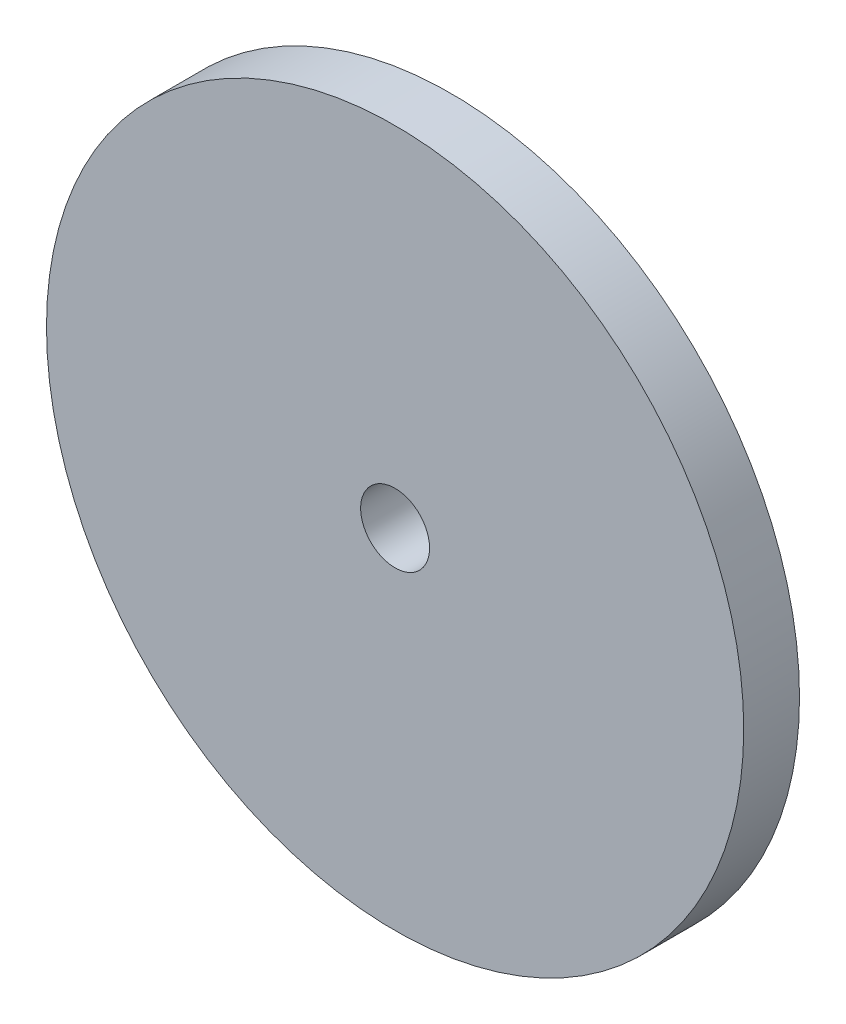
ISO-10303-21;
HEADER;
FILE_DESCRIPTION(('STEP AP214'),'2;1');
FILE_NAME('part.step','',(''),(''),'','','');
FILE_SCHEMA(('AUTOMOTIVE_DESIGN { 1 0 10303 214 1 1 1 1 }'));
ENDSEC;
DATA;
#1=APPLICATION_CONTEXT('core data for automotive mechanical design processes');
#2=APPLICATION_PROTOCOL_DEFINITION('international standard','automotive_design',2000,#1);
#3=PRODUCT_CONTEXT('',#1,'mechanical');
#4=PRODUCT('Part','Part','',(#3));
#5=PRODUCT_RELATED_PRODUCT_CATEGORY('part','',(#4));
#6=PRODUCT_DEFINITION_FORMATION('','',#4);
#7=PRODUCT_DEFINITION_CONTEXT('part definition',#1,'design');
#8=PRODUCT_DEFINITION('design','',#6,#7);
#9=PRODUCT_DEFINITION_SHAPE('','',#8);
#10=(LENGTH_UNIT() NAMED_UNIT(*) SI_UNIT(.MILLI.,.METRE.));
#11=(NAMED_UNIT(*) PLANE_ANGLE_UNIT() SI_UNIT($,.RADIAN.));
#12=(NAMED_UNIT(*) SI_UNIT($,.STERADIAN.) SOLID_ANGLE_UNIT());
#13=UNCERTAINTY_MEASURE_WITH_UNIT(LENGTH_MEASURE(1.E-05),#10,'distance_accuracy_value','');
#14=(GEOMETRIC_REPRESENTATION_CONTEXT(3) GLOBAL_UNCERTAINTY_ASSIGNED_CONTEXT((#13)) GLOBAL_UNIT_ASSIGNED_CONTEXT((#10,
#11,#12)) REPRESENTATION_CONTEXT('',''));
#15=CARTESIAN_POINT('',(0.,0.,0.));
#16=DIRECTION('',(0.,0.,1.));
#17=DIRECTION('',(1.,0.,0.));
#18=AXIS2_PLACEMENT_3D('',#15,#16,#17);
#19=CARTESIAN_POINT('',(0.,0.,0.));
#20=DIRECTION('',(0.,0.,1.));
#21=DIRECTION('',(1.,0.,0.));
#22=AXIS2_PLACEMENT_3D('',#19,#20,#21);
#23=CYLINDRICAL_SURFACE('',#22,3.1369);
#24=CARTESIAN_POINT('',(0.,0.,-5.08));
#25=DIRECTION('',(0.,0.,1.));
#26=DIRECTION('',(1.,0.,0.));
#27=AXIS2_PLACEMENT_3D('',#24,#25,#26);
#28=CIRCLE('',#27,3.1369);
#29=CARTESIAN_POINT('',(3.1369,0.,-5.08));
#30=VERTEX_POINT('',#29);
#31=EDGE_CURVE('E45',#30,#30,#28,.T.);
#32=ORIENTED_EDGE('',*,*,#31,.F.);
#33=EDGE_LOOP('',(#32));
#34=FACE_BOUND('',#33,.T.);
#35=CARTESIAN_POINT('',(0.,0.,0.));
#36=DIRECTION('',(0.,0.,1.));
#37=DIRECTION('',(1.,0.,0.));
#38=AXIS2_PLACEMENT_3D('',#35,#36,#37);
#39=CIRCLE('',#38,3.1369);
#40=CARTESIAN_POINT('',(3.1369,0.,0.));
#41=VERTEX_POINT('',#40);
#42=EDGE_CURVE('E10',#41,#41,#39,.T.);
#43=ORIENTED_EDGE('',*,*,#42,.T.);
#44=EDGE_LOOP('',(#43));
#45=FACE_BOUND('',#44,.T.);
#46=ADVANCED_FACE('F31',(#34,#45),#23,.F.);
#47=CARTESIAN_POINT('',(0.,3.1369,0.));
#48=DIRECTION('',(0.,0.,-1.));
#49=DIRECTION('',(-1.,0.,0.));
#50=AXIS2_PLACEMENT_3D('',#47,#48,#49);
#51=PLANE('',#50);
#52=ORIENTED_EDGE('',*,*,#42,.F.);
#53=EDGE_LOOP('',(#52));
#54=FACE_BOUND('',#53,.T.);
#55=CARTESIAN_POINT('',(0.,0.,0.));
#56=DIRECTION('',(0.,0.,1.));
#57=DIRECTION('',(1.,0.,0.));
#58=AXIS2_PLACEMENT_3D('',#55,#56,#57);
#59=CIRCLE('',#58,31.75);
#60=CARTESIAN_POINT('',(31.75,0.,0.));
#61=VERTEX_POINT('',#60);
#62=EDGE_CURVE('E37',#61,#61,#59,.T.);
#63=ORIENTED_EDGE('',*,*,#62,.T.);
#64=EDGE_LOOP('',(#63));
#65=FACE_BOUND('',#64,.T.);
#66=ADVANCED_FACE('F54',(#54,#65),#51,.F.);
#67=CARTESIAN_POINT('',(0.,0.,0.));
#68=DIRECTION('',(0.,0.,1.));
#69=DIRECTION('',(1.,0.,0.));
#70=AXIS2_PLACEMENT_3D('',#67,#68,#69);
#71=CYLINDRICAL_SURFACE('',#70,31.75);
#72=ORIENTED_EDGE('',*,*,#62,.F.);
#73=EDGE_LOOP('',(#72));
#74=FACE_BOUND('',#73,.T.);
#75=CARTESIAN_POINT('',(0.,0.,-5.08));
#76=DIRECTION('',(0.,0.,1.));
#77=DIRECTION('',(1.,0.,0.));
#78=AXIS2_PLACEMENT_3D('',#75,#76,#77);
#79=CIRCLE('',#78,31.75);
#80=CARTESIAN_POINT('',(31.75,0.,-5.08));
#81=VERTEX_POINT('',#80);
#82=EDGE_CURVE('E41',#81,#81,#79,.T.);
#83=ORIENTED_EDGE('',*,*,#82,.T.);
#84=EDGE_LOOP('',(#83));
#85=FACE_BOUND('',#84,.T.);
#86=ADVANCED_FACE('F58',(#74,#85),#71,.T.);
#87=CARTESIAN_POINT('',(0.,31.75,-5.08));
#88=DIRECTION('',(0.,0.,1.));
#89=DIRECTION('',(1.,0.,0.));
#90=AXIS2_PLACEMENT_3D('',#87,#88,#89);
#91=PLANE('',#90);
#92=ORIENTED_EDGE('',*,*,#82,.F.);
#93=EDGE_LOOP('',(#92));
#94=FACE_BOUND('',#93,.T.);
#95=ORIENTED_EDGE('',*,*,#31,.T.);
#96=EDGE_LOOP('',(#95));
#97=FACE_BOUND('',#96,.T.);
#98=ADVANCED_FACE('F51',(#94,#97),#91,.F.);
#99=CLOSED_SHELL('',(#46,#66,#86,#98));
#100=MANIFOLD_SOLID_BREP('B2',#99);
#101=ADVANCED_BREP_SHAPE_REPRESENTATION('',(#18,#100),#14);
#102=SHAPE_DEFINITION_REPRESENTATION(#9,#101);
ENDSEC;
END-ISO-10303-21;
